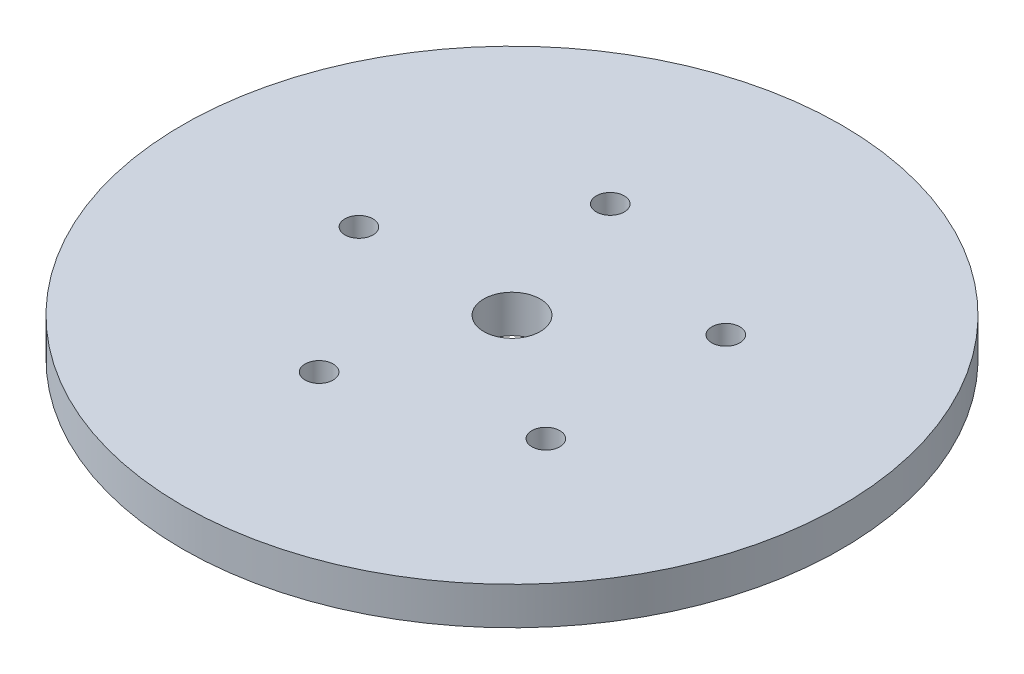
ISO-10303-21;
HEADER;
FILE_DESCRIPTION(('STEP AP214'),'2;1');
FILE_NAME('part.step','',(''),(''),'','','');
FILE_SCHEMA(('AUTOMOTIVE_DESIGN { 1 0 10303 214 1 1 1 1 }'));
ENDSEC;
DATA;
#1=APPLICATION_CONTEXT('core data for automotive mechanical design processes');
#2=APPLICATION_PROTOCOL_DEFINITION('international standard','automotive_design',2000,#1);
#3=PRODUCT_CONTEXT('',#1,'mechanical');
#4=PRODUCT('Part','Part','',(#3));
#5=PRODUCT_RELATED_PRODUCT_CATEGORY('part','',(#4));
#6=PRODUCT_DEFINITION_FORMATION('','',#4);
#7=PRODUCT_DEFINITION_CONTEXT('part definition',#1,'design');
#8=PRODUCT_DEFINITION('design','',#6,#7);
#9=PRODUCT_DEFINITION_SHAPE('','',#8);
#10=(LENGTH_UNIT() NAMED_UNIT(*) SI_UNIT(.MILLI.,.METRE.));
#11=(NAMED_UNIT(*) PLANE_ANGLE_UNIT() SI_UNIT($,.RADIAN.));
#12=(NAMED_UNIT(*) SI_UNIT($,.STERADIAN.) SOLID_ANGLE_UNIT());
#13=UNCERTAINTY_MEASURE_WITH_UNIT(LENGTH_MEASURE(1.E-05),#10,'distance_accuracy_value','');
#14=(GEOMETRIC_REPRESENTATION_CONTEXT(3) GLOBAL_UNCERTAINTY_ASSIGNED_CONTEXT((#13)) GLOBAL_UNIT_ASSIGNED_CONTEXT((#10,
#11,#12)) REPRESENTATION_CONTEXT('',''));
#15=CARTESIAN_POINT('',(0.,0.,0.));
#16=DIRECTION('',(0.,0.,1.));
#17=DIRECTION('',(1.,0.,0.));
#18=AXIS2_PLACEMENT_3D('',#15,#16,#17);
#19=CARTESIAN_POINT('',(0.,10.,0.));
#20=DIRECTION('',(0.,-1.,0.));
#21=DIRECTION('',(0.,0.,-1.));
#22=AXIS2_PLACEMENT_3D('',#19,#20,#21);
#23=CYLINDRICAL_SURFACE('',#22,87.5);
#24=CARTESIAN_POINT('',(0.,10.,0.));
#25=DIRECTION('',(0.,1.,0.));
#26=DIRECTION('',(0.,0.,1.));
#27=AXIS2_PLACEMENT_3D('',#24,#25,#26);
#28=CIRCLE('',#27,87.5);
#29=CARTESIAN_POINT('',(0.,10.,87.5));
#30=VERTEX_POINT('',#29);
#31=EDGE_CURVE('E10',#30,#30,#28,.T.);
#32=ORIENTED_EDGE('',*,*,#31,.F.);
#33=EDGE_LOOP('',(#32));
#34=FACE_BOUND('',#33,.T.);
#35=CARTESIAN_POINT('',(0.,0.,0.));
#36=DIRECTION('',(0.,1.,0.));
#37=DIRECTION('',(0.,0.,1.));
#38=AXIS2_PLACEMENT_3D('',#35,#36,#37);
#39=CIRCLE('',#38,87.5);
#40=CARTESIAN_POINT('',(0.,0.,87.5));
#41=VERTEX_POINT('',#40);
#42=EDGE_CURVE('E37',#41,#41,#39,.T.);
#43=ORIENTED_EDGE('',*,*,#42,.T.);
#44=EDGE_LOOP('',(#43));
#45=FACE_BOUND('',#44,.T.);
#46=ADVANCED_FACE('F40',(#34,#45),#23,.T.);
#47=CARTESIAN_POINT('',(0.,10.,0.));
#48=DIRECTION('',(0.,1.,0.));
#49=DIRECTION('',(0.,0.,1.));
#50=AXIS2_PLACEMENT_3D('',#47,#48,#49);
#51=PLANE('',#50);
#52=CARTESIAN_POINT('',(-12.5591347270196,10.,38.6530421905147));
#53=DIRECTION('',(0.,1.,0.));
#54=DIRECTION('',(0.951056516295155,0.,0.309016994374945));
#55=AXIS2_PLACEMENT_3D('',#52,#53,#54);
#56=CIRCLE('',#55,3.7215778145133);
#57=CARTESIAN_POINT('',(-9.01970389562727,10.,39.8030729810881));
#58=VERTEX_POINT('',#57);
#59=EDGE_CURVE('E78',#58,#58,#56,.T.);
#60=ORIENTED_EDGE('',*,*,#59,.F.);
#61=EDGE_LOOP('',(#60));
#62=FACE_BOUND('',#61,.T.);
#63=CARTESIAN_POINT('',(32.8802415846269,10.,23.8888938423216));
#64=DIRECTION('',(0.,1.,0.));
#65=DIRECTION('',(0.587785252292469,0.,-0.809016994374951));
#66=AXIS2_PLACEMENT_3D('',#63,#64,#65);
#67=CIRCLE('',#66,3.7215778145133);
#68=CARTESIAN_POINT('',(35.0677301392567,10.,20.8780741444915));
#69=VERTEX_POINT('',#68);
#70=EDGE_CURVE('E71',#69,#69,#67,.T.);
#71=ORIENTED_EDGE('',*,*,#70,.F.);
#72=EDGE_LOOP('',(#71));
#73=FACE_BOUND('',#72,.T.);
#74=CARTESIAN_POINT('',(32.8802415846266,10.,-23.888893842322));
#75=DIRECTION('',(0.,1.,0.));
#76=DIRECTION('',(-0.58778525229248,0.,-0.809016994374942));
#77=AXIS2_PLACEMENT_3D('',#74,#75,#76);
#78=CIRCLE('',#77,3.7215778145133);
#79=CARTESIAN_POINT('',(30.6927530299968,10.,-26.899713540152));
#80=VERTEX_POINT('',#79);
#81=EDGE_CURVE('E70',#80,#80,#78,.T.);
#82=ORIENTED_EDGE('',*,*,#81,.F.);
#83=EDGE_LOOP('',(#82));
#84=FACE_BOUND('',#83,.T.);
#85=CARTESIAN_POINT('',(-12.5591347270202,10.,-38.6530421905145));
#86=DIRECTION('',(0.,1.,0.));
#87=DIRECTION('',(-0.95105651629515,0.,0.309016994374958));
#88=AXIS2_PLACEMENT_3D('',#85,#86,#87);
#89=CIRCLE('',#88,3.7215778145133);
#90=CARTESIAN_POINT('',(-16.0985655584125,10.,-37.5030113999411));
#91=VERTEX_POINT('',#90);
#92=EDGE_CURVE('E61',#91,#91,#89,.T.);
#93=ORIENTED_EDGE('',*,*,#92,.F.);
#94=EDGE_LOOP('',(#93));
#95=FACE_BOUND('',#94,.T.);
#96=CARTESIAN_POINT('',(-40.6422137152141,10.,0.));
#97=DIRECTION('',(0.,1.,0.));
#98=DIRECTION('',(0.,0.,1.));
#99=AXIS2_PLACEMENT_3D('',#96,#97,#98);
#100=CIRCLE('',#99,3.7215778145133);
#101=CARTESIAN_POINT('',(-40.6422137152141,10.,3.7215778145133));
#102=VERTEX_POINT('',#101);
#103=EDGE_CURVE('E54',#102,#102,#100,.T.);
#104=ORIENTED_EDGE('',*,*,#103,.F.);
#105=EDGE_LOOP('',(#104));
#106=FACE_BOUND('',#105,.T.);
#107=CARTESIAN_POINT('',(0.,10.,0.));
#108=DIRECTION('',(0.,1.,0.));
#109=DIRECTION('',(0.,0.,1.));
#110=AXIS2_PLACEMENT_3D('',#107,#108,#109);
#111=CIRCLE('',#110,7.5);
#112=CARTESIAN_POINT('',(0.,10.,7.5));
#113=VERTEX_POINT('',#112);
#114=EDGE_CURVE('E50',#113,#113,#111,.T.);
#115=ORIENTED_EDGE('',*,*,#114,.F.);
#116=EDGE_LOOP('',(#115));
#117=FACE_BOUND('',#116,.T.);
#118=ORIENTED_EDGE('',*,*,#31,.T.);
#119=EDGE_LOOP('',(#118));
#120=FACE_BOUND('',#119,.T.);
#121=ADVANCED_FACE('F94',(#62,#73,#84,#95,#106,#117,#120),#51,.T.);
#122=CARTESIAN_POINT('',(0.,0.,0.));
#123=DIRECTION('',(0.,1.,0.));
#124=DIRECTION('',(0.,0.,1.));
#125=AXIS2_PLACEMENT_3D('',#122,#123,#124);
#126=PLANE('',#125);
#127=CARTESIAN_POINT('',(0.,0.,0.));
#128=DIRECTION('',(0.,1.,0.));
#129=DIRECTION('',(0.,0.,1.));
#130=AXIS2_PLACEMENT_3D('',#127,#128,#129);
#131=CIRCLE('',#130,7.5);
#132=CARTESIAN_POINT('',(0.,0.,7.5));
#133=VERTEX_POINT('',#132);
#134=EDGE_CURVE('E47',#133,#133,#131,.T.);
#135=ORIENTED_EDGE('',*,*,#134,.T.);
#136=EDGE_LOOP('',(#135));
#137=FACE_BOUND('',#136,.T.);
#138=ORIENTED_EDGE('',*,*,#42,.F.);
#139=EDGE_LOOP('',(#138));
#140=FACE_BOUND('',#139,.T.);
#141=ADVANCED_FACE('F100',(#137,#140),#126,.F.);
#142=CARTESIAN_POINT('',(0.,10.,0.));
#143=DIRECTION('',(0.,-1.,0.));
#144=DIRECTION('',(0.,0.,-1.));
#145=AXIS2_PLACEMENT_3D('',#142,#143,#144);
#146=CYLINDRICAL_SURFACE('',#145,7.5);
#147=ORIENTED_EDGE('',*,*,#114,.T.);
#148=EDGE_LOOP('',(#147));
#149=FACE_BOUND('',#148,.T.);
#150=ORIENTED_EDGE('',*,*,#134,.F.);
#151=EDGE_LOOP('',(#150));
#152=FACE_BOUND('',#151,.T.);
#153=ADVANCED_FACE('F108',(#149,#152),#146,.F.);
#154=CARTESIAN_POINT('',(-40.6422137152141,1.58596632604339,0.));
#155=DIRECTION('',(0.,1.,0.));
#156=DIRECTION('',(0.,0.,1.));
#157=AXIS2_PLACEMENT_3D('',#154,#155,#156);
#158=CYLINDRICAL_SURFACE('',#157,3.7215778145133);
#159=CARTESIAN_POINT('',(-40.6422137152141,1.58596632604339,0.));
#160=DIRECTION('',(0.,1.,0.));
#161=DIRECTION('',(0.,0.,1.));
#162=AXIS2_PLACEMENT_3D('',#159,#160,#161);
#163=CIRCLE('',#162,3.7215778145133);
#164=CARTESIAN_POINT('',(-40.6422137152141,1.58596632604339,3.7215778145133));
#165=VERTEX_POINT('',#164);
#166=EDGE_CURVE('E55',#165,#165,#163,.T.);
#167=ORIENTED_EDGE('',*,*,#166,.F.);
#168=EDGE_LOOP('',(#167));
#169=FACE_BOUND('',#168,.T.);
#170=ORIENTED_EDGE('',*,*,#103,.T.);
#171=EDGE_LOOP('',(#170));
#172=FACE_BOUND('',#171,.T.);
#173=ADVANCED_FACE('F115',(#169,#172),#158,.F.);
#174=CARTESIAN_POINT('',(-40.6422137152141,1.58596632604339,0.));
#175=DIRECTION('',(0.,1.,0.));
#176=DIRECTION('',(0.,0.,1.));
#177=AXIS2_PLACEMENT_3D('',#174,#175,#176);
#178=PLANE('',#177);
#179=ORIENTED_EDGE('',*,*,#166,.T.);
#180=EDGE_LOOP('',(#179));
#181=FACE_BOUND('',#180,.T.);
#182=ADVANCED_FACE('F142',(#181),#178,.T.);
#183=CARTESIAN_POINT('',(-12.5591347270202,1.58596632604339,-38.6530421905145));
#184=DIRECTION('',(0.,1.,0.));
#185=DIRECTION('',(0.,0.,1.));
#186=AXIS2_PLACEMENT_3D('',#183,#184,#185);
#187=CYLINDRICAL_SURFACE('',#186,3.7215778145133);
#188=CARTESIAN_POINT('',(-12.5591347270202,1.58596632604339,-38.6530421905145));
#189=DIRECTION('',(0.,1.,0.));
#190=DIRECTION('',(-0.95105651629515,0.,0.309016994374958));
#191=AXIS2_PLACEMENT_3D('',#188,#189,#190);
#192=CIRCLE('',#191,3.7215778145133);
#193=CARTESIAN_POINT('',(-16.0985655584125,1.58596632604339,-37.5030113999411));
#194=VERTEX_POINT('',#193);
#195=EDGE_CURVE('E63',#194,#194,#192,.T.);
#196=ORIENTED_EDGE('',*,*,#195,.F.);
#197=EDGE_LOOP('',(#196));
#198=FACE_BOUND('',#197,.T.);
#199=ORIENTED_EDGE('',*,*,#92,.T.);
#200=EDGE_LOOP('',(#199));
#201=FACE_BOUND('',#200,.T.);
#202=ADVANCED_FACE('F147',(#198,#201),#187,.F.);
#203=CARTESIAN_POINT('',(-12.5591347270202,1.58596632604339,-38.6530421905145));
#204=DIRECTION('',(0.,1.,0.));
#205=DIRECTION('',(-0.95105651629515,0.,0.309016994374958));
#206=AXIS2_PLACEMENT_3D('',#203,#204,#205);
#207=PLANE('',#206);
#208=ORIENTED_EDGE('',*,*,#195,.T.);
#209=EDGE_LOOP('',(#208));
#210=FACE_BOUND('',#209,.T.);
#211=ADVANCED_FACE('F163',(#210),#207,.T.);
#212=CARTESIAN_POINT('',(32.8802415846266,1.58596632604339,-23.888893842322));
#213=DIRECTION('',(0.,1.,0.));
#214=DIRECTION('',(0.,0.,1.));
#215=AXIS2_PLACEMENT_3D('',#212,#213,#214);
#216=CYLINDRICAL_SURFACE('',#215,3.7215778145133);
#217=CARTESIAN_POINT('',(32.8802415846266,1.58596632604339,-23.888893842322));
#218=DIRECTION('',(0.,1.,0.));
#219=DIRECTION('',(-0.58778525229248,0.,-0.809016994374942));
#220=AXIS2_PLACEMENT_3D('',#217,#218,#219);
#221=CIRCLE('',#220,3.7215778145133);
#222=CARTESIAN_POINT('',(30.6927530299968,1.58596632604339,-26.899713540152));
#223=VERTEX_POINT('',#222);
#224=EDGE_CURVE('E69',#223,#223,#221,.T.);
#225=ORIENTED_EDGE('',*,*,#224,.F.);
#226=EDGE_LOOP('',(#225));
#227=FACE_BOUND('',#226,.T.);
#228=ORIENTED_EDGE('',*,*,#81,.T.);
#229=EDGE_LOOP('',(#228));
#230=FACE_BOUND('',#229,.T.);
#231=ADVANCED_FACE('F172',(#227,#230),#216,.F.);
#232=CARTESIAN_POINT('',(32.8802415846266,1.58596632604339,-23.888893842322));
#233=DIRECTION('',(0.,1.,0.));
#234=DIRECTION('',(-0.58778525229248,0.,-0.809016994374942));
#235=AXIS2_PLACEMENT_3D('',#232,#233,#234);
#236=PLANE('',#235);
#237=ORIENTED_EDGE('',*,*,#224,.T.);
#238=EDGE_LOOP('',(#237));
#239=FACE_BOUND('',#238,.T.);
#240=ADVANCED_FACE('F185',(#239),#236,.T.);
#241=CARTESIAN_POINT('',(32.8802415846269,1.58596632604339,23.8888938423216));
#242=DIRECTION('',(0.,1.,0.));
#243=DIRECTION('',(0.,0.,1.));
#244=AXIS2_PLACEMENT_3D('',#241,#242,#243);
#245=CYLINDRICAL_SURFACE('',#244,3.7215778145133);
#246=CARTESIAN_POINT('',(32.8802415846269,1.58596632604339,23.8888938423216));
#247=DIRECTION('',(0.,1.,0.));
#248=DIRECTION('',(0.587785252292469,0.,-0.809016994374951));
#249=AXIS2_PLACEMENT_3D('',#246,#247,#248);
#250=CIRCLE('',#249,3.7215778145133);
#251=CARTESIAN_POINT('',(35.0677301392567,1.58596632604339,20.8780741444915));
#252=VERTEX_POINT('',#251);
#253=EDGE_CURVE('E76',#252,#252,#250,.T.);
#254=ORIENTED_EDGE('',*,*,#253,.F.);
#255=EDGE_LOOP('',(#254));
#256=FACE_BOUND('',#255,.T.);
#257=ORIENTED_EDGE('',*,*,#70,.T.);
#258=EDGE_LOOP('',(#257));
#259=FACE_BOUND('',#258,.T.);
#260=ADVANCED_FACE('F191',(#256,#259),#245,.F.);
#261=CARTESIAN_POINT('',(32.8802415846269,1.58596632604339,23.8888938423216));
#262=DIRECTION('',(0.,1.,0.));
#263=DIRECTION('',(0.587785252292469,0.,-0.809016994374951));
#264=AXIS2_PLACEMENT_3D('',#261,#262,#263);
#265=PLANE('',#264);
#266=ORIENTED_EDGE('',*,*,#253,.T.);
#267=EDGE_LOOP('',(#266));
#268=FACE_BOUND('',#267,.T.);
#269=ADVANCED_FACE('F89',(#268),#265,.T.);
#270=CARTESIAN_POINT('',(-12.5591347270196,1.58596632604339,38.6530421905147));
#271=DIRECTION('',(0.,1.,0.));
#272=DIRECTION('',(0.,0.,1.));
#273=AXIS2_PLACEMENT_3D('',#270,#271,#272);
#274=CYLINDRICAL_SURFACE('',#273,3.7215778145133);
#275=CARTESIAN_POINT('',(-12.5591347270196,1.58596632604339,38.6530421905147));
#276=DIRECTION('',(0.,1.,0.));
#277=DIRECTION('',(0.951056516295155,0.,0.309016994374945));
#278=AXIS2_PLACEMENT_3D('',#275,#276,#277);
#279=CIRCLE('',#278,3.7215778145133);
#280=CARTESIAN_POINT('',(-9.01970389562727,1.58596632604339,39.8030729810881));
#281=VERTEX_POINT('',#280);
#282=EDGE_CURVE('E59',#281,#281,#279,.T.);
#283=ORIENTED_EDGE('',*,*,#282,.F.);
#284=EDGE_LOOP('',(#283));
#285=FACE_BOUND('',#284,.T.);
#286=ORIENTED_EDGE('',*,*,#59,.T.);
#287=EDGE_LOOP('',(#286));
#288=FACE_BOUND('',#287,.T.);
#289=ADVANCED_FACE('F87',(#285,#288),#274,.F.);
#290=CARTESIAN_POINT('',(-12.5591347270196,1.58596632604339,38.6530421905147));
#291=DIRECTION('',(0.,1.,0.));
#292=DIRECTION('',(0.951056516295155,0.,0.309016994374945));
#293=AXIS2_PLACEMENT_3D('',#290,#291,#292);
#294=PLANE('',#293);
#295=ORIENTED_EDGE('',*,*,#282,.T.);
#296=EDGE_LOOP('',(#295));
#297=FACE_BOUND('',#296,.T.);
#298=ADVANCED_FACE('F84',(#297),#294,.T.);
#299=CLOSED_SHELL('',(#46,#121,#141,#153,#173,#182,#202,#211,#231,#240,#260,#269,#289,#298));
#300=MANIFOLD_SOLID_BREP('B2',#299);
#301=ADVANCED_BREP_SHAPE_REPRESENTATION('',(#18,#300),#14);
#302=SHAPE_DEFINITION_REPRESENTATION(#9,#301);
ENDSEC;
END-ISO-10303-21;
